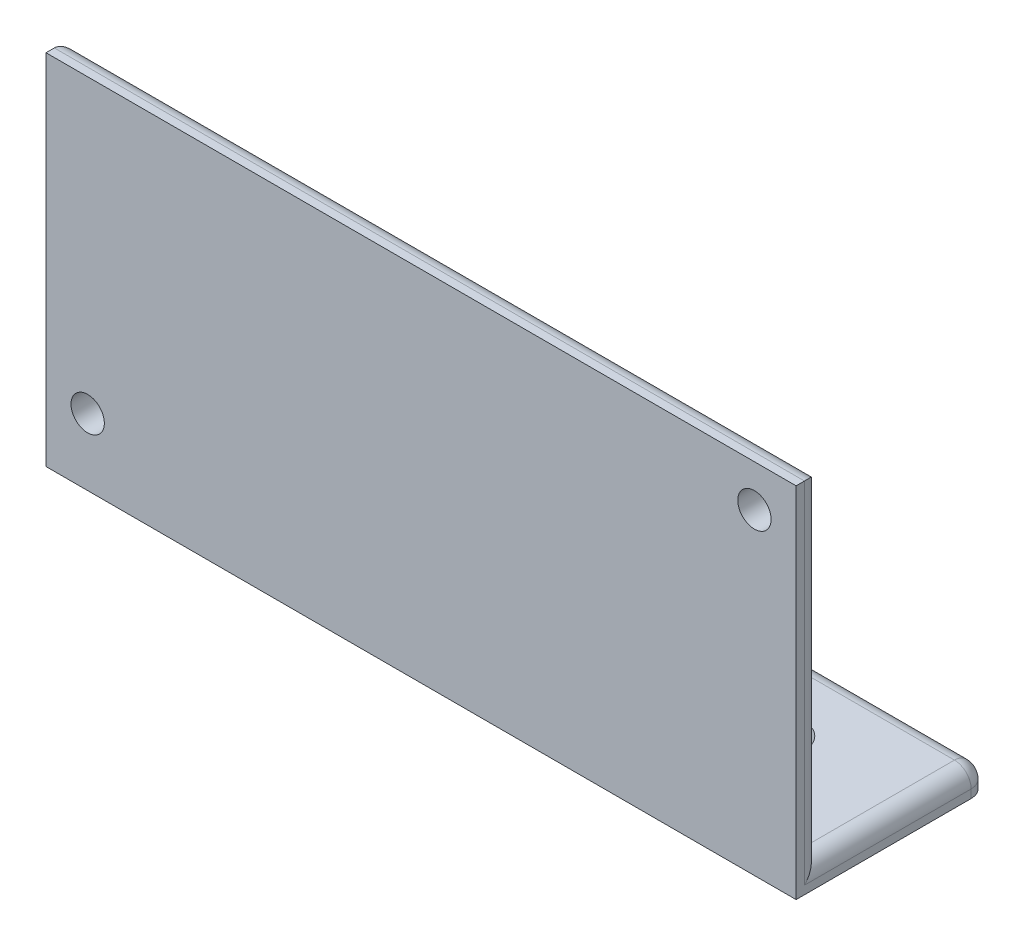
ISO-10303-21;
HEADER;
FILE_DESCRIPTION(('STEP AP214'),'2;1');
FILE_NAME('part.step','',(''),(''),'','','');
FILE_SCHEMA(('AUTOMOTIVE_DESIGN { 1 0 10303 214 1 1 1 1 }'));
ENDSEC;
DATA;
#1=APPLICATION_CONTEXT('core data for automotive mechanical design processes');
#2=APPLICATION_PROTOCOL_DEFINITION('international standard','automotive_design',2000,#1);
#3=PRODUCT_CONTEXT('',#1,'mechanical');
#4=PRODUCT('Part','Part','',(#3));
#5=PRODUCT_RELATED_PRODUCT_CATEGORY('part','',(#4));
#6=PRODUCT_DEFINITION_FORMATION('','',#4);
#7=PRODUCT_DEFINITION_CONTEXT('part definition',#1,'design');
#8=PRODUCT_DEFINITION('design','',#6,#7);
#9=PRODUCT_DEFINITION_SHAPE('','',#8);
#10=(LENGTH_UNIT() NAMED_UNIT(*) SI_UNIT(.MILLI.,.METRE.));
#11=(NAMED_UNIT(*) PLANE_ANGLE_UNIT() SI_UNIT($,.RADIAN.));
#12=(NAMED_UNIT(*) SI_UNIT($,.STERADIAN.) SOLID_ANGLE_UNIT());
#13=UNCERTAINTY_MEASURE_WITH_UNIT(LENGTH_MEASURE(1.E-05),#10,'distance_accuracy_value','');
#14=(GEOMETRIC_REPRESENTATION_CONTEXT(3) GLOBAL_UNCERTAINTY_ASSIGNED_CONTEXT((#13)) GLOBAL_UNIT_ASSIGNED_CONTEXT((#10,
#11,#12)) REPRESENTATION_CONTEXT('',''));
#15=CARTESIAN_POINT('',(0.,0.,0.));
#16=DIRECTION('',(0.,0.,1.));
#17=DIRECTION('',(1.,0.,0.));
#18=AXIS2_PLACEMENT_3D('',#15,#16,#17);
#19=CARTESIAN_POINT('',(0.,0.,1.5));
#20=DIRECTION('',(0.,0.,1.));
#21=DIRECTION('',(1.,0.,0.));
#22=AXIS2_PLACEMENT_3D('',#19,#20,#21);
#23=PLANE('',#22);
#24=CARTESIAN_POINT('',(20.,7.5,1.5));
#25=DIRECTION('',(0.,0.,1.));
#26=DIRECTION('',(1.,0.,0.));
#27=AXIS2_PLACEMENT_3D('',#24,#25,#26);
#28=CIRCLE('',#27,1.);
#29=CARTESIAN_POINT('',(21.,7.5,1.5));
#30=VERTEX_POINT('',#29);
#31=EDGE_CURVE('E169',#30,#30,#28,.T.);
#32=ORIENTED_EDGE('',*,*,#31,.F.);
#33=EDGE_LOOP('',(#32));
#34=FACE_BOUND('',#33,.T.);
#35=DIRECTION('',(0.,-1.,0.));
#36=VECTOR('',#35,1.);
#37=CARTESIAN_POINT('',(-22.5,10.,1.5));
#38=LINE('',#37,#36);
#39=CARTESIAN_POINT('',(-22.5,10.,1.5));
#40=VERTEX_POINT('',#39);
#41=CARTESIAN_POINT('',(-22.5,-11.5,1.5));
#42=VERTEX_POINT('',#41);
#43=EDGE_CURVE('E146',#40,#42,#38,.T.);
#44=ORIENTED_EDGE('',*,*,#43,.T.);
#45=DIRECTION('',(-1.,0.,0.));
#46=VECTOR('',#45,1.);
#47=CARTESIAN_POINT('',(22.5,-11.5,1.5));
#48=LINE('',#47,#46);
#49=CARTESIAN_POINT('',(22.5,-11.5,1.5));
#50=VERTEX_POINT('',#49);
#51=EDGE_CURVE('E127',#50,#42,#48,.T.);
#52=ORIENTED_EDGE('',*,*,#51,.F.);
#53=DIRECTION('',(0.,1.,0.));
#54=VECTOR('',#53,1.);
#55=CARTESIAN_POINT('',(22.5,10.,1.5));
#56=LINE('',#55,#54);
#57=CARTESIAN_POINT('',(22.5,10.,1.5));
#58=VERTEX_POINT('',#57);
#59=EDGE_CURVE('E138',#50,#58,#56,.T.);
#60=ORIENTED_EDGE('',*,*,#59,.T.);
#61=DIRECTION('',(-1.,0.,0.));
#62=VECTOR('',#61,1.);
#63=CARTESIAN_POINT('',(-22.5,10.,1.5));
#64=LINE('',#63,#62);
#65=EDGE_CURVE('E145',#58,#40,#64,.T.);
#66=ORIENTED_EDGE('',*,*,#65,.T.);
#67=EDGE_LOOP('',(#44,#52,#60,#66));
#68=FACE_BOUND('',#67,.T.);
#69=CARTESIAN_POINT('',(-20.0000000000001,-7.49999999999986,1.5));
#70=DIRECTION('',(0.,0.,1.));
#71=DIRECTION('',(1.,0.,0.));
#72=AXIS2_PLACEMENT_3D('',#69,#70,#71);
#73=CIRCLE('',#72,1.);
#74=CARTESIAN_POINT('',(-19.0000000000001,-7.49999999999986,1.5));
#75=VERTEX_POINT('',#74);
#76=EDGE_CURVE('E161',#75,#75,#73,.T.);
#77=ORIENTED_EDGE('',*,*,#76,.F.);
#78=EDGE_LOOP('',(#77));
#79=FACE_BOUND('',#78,.T.);
#80=ADVANCED_FACE('F38',(#34,#68,#79),#23,.T.);
#81=CARTESIAN_POINT('',(0.,0.,0.));
#82=DIRECTION('',(0.,0.,1.));
#83=DIRECTION('',(1.,0.,0.));
#84=AXIS2_PLACEMENT_3D('',#81,#82,#83);
#85=PLANE('',#84);
#86=DIRECTION('',(1.,0.,0.));
#87=VECTOR('',#86,1.);
#88=CARTESIAN_POINT('',(-22.5,-10.,0.));
#89=LINE('',#88,#87);
#90=CARTESIAN_POINT('',(-21.5,-10.,0.));
#91=VERTEX_POINT('',#90);
#92=CARTESIAN_POINT('',(21.5,-10.,0.));
#93=VERTEX_POINT('',#92);
#94=EDGE_CURVE('E173',#91,#93,#89,.T.);
#95=ORIENTED_EDGE('',*,*,#94,.F.);
#96=DIRECTION('',(0.,-1.,0.));
#97=VECTOR('',#96,1.);
#98=CARTESIAN_POINT('',(-21.5,0.,0.));
#99=LINE('',#98,#97);
#100=CARTESIAN_POINT('',(-21.5,9.,0.));
#101=VERTEX_POINT('',#100);
#102=EDGE_CURVE('E48',#91,#101,#99,.F.);
#103=ORIENTED_EDGE('',*,*,#102,.T.);
#104=DIRECTION('',(-1.,0.,0.));
#105=VECTOR('',#104,1.);
#106=CARTESIAN_POINT('',(0.,9.,0.));
#107=LINE('',#106,#105);
#108=CARTESIAN_POINT('',(21.5,9.,0.));
#109=VERTEX_POINT('',#108);
#110=EDGE_CURVE('E56',#101,#109,#107,.F.);
#111=ORIENTED_EDGE('',*,*,#110,.T.);
#112=DIRECTION('',(0.,1.,0.));
#113=VECTOR('',#112,1.);
#114=CARTESIAN_POINT('',(21.5,0.,0.));
#115=LINE('',#114,#113);
#116=EDGE_CURVE('E235',#109,#93,#115,.F.);
#117=ORIENTED_EDGE('',*,*,#116,.T.);
#118=EDGE_LOOP('',(#95,#103,#111,#117));
#119=FACE_BOUND('',#118,.T.);
#120=CARTESIAN_POINT('',(20.,7.5,0.));
#121=DIRECTION('',(0.,0.,1.));
#122=DIRECTION('',(1.,0.,0.));
#123=AXIS2_PLACEMENT_3D('',#120,#121,#122);
#124=CIRCLE('',#123,1.);
#125=CARTESIAN_POINT('',(21.,7.5,0.));
#126=VERTEX_POINT('',#125);
#127=EDGE_CURVE('E165',#126,#126,#124,.T.);
#128=ORIENTED_EDGE('',*,*,#127,.T.);
#129=EDGE_LOOP('',(#128));
#130=FACE_BOUND('',#129,.T.);
#131=CARTESIAN_POINT('',(-20.0000000000001,-7.49999999999986,0.));
#132=DIRECTION('',(0.,0.,1.));
#133=DIRECTION('',(1.,0.,0.));
#134=AXIS2_PLACEMENT_3D('',#131,#132,#133);
#135=CIRCLE('',#134,1.);
#136=CARTESIAN_POINT('',(-19.0000000000001,-7.49999999999986,0.));
#137=VERTEX_POINT('',#136);
#138=EDGE_CURVE('E160',#137,#137,#135,.T.);
#139=ORIENTED_EDGE('',*,*,#138,.T.);
#140=EDGE_LOOP('',(#139));
#141=FACE_BOUND('',#140,.T.);
#142=ADVANCED_FACE('F319',(#119,#130,#141),#85,.F.);
#143=CARTESIAN_POINT('',(-22.5,10.,1.5));
#144=DIRECTION('',(1.,0.,0.));
#145=DIRECTION('',(0.,1.,0.));
#146=AXIS2_PLACEMENT_3D('',#143,#144,#145);
#147=PLANE('',#146);
#148=DIRECTION('',(0.,0.,-1.));
#149=VECTOR('',#148,1.);
#150=CARTESIAN_POINT('',(-22.5,-11.,-10.));
#151=LINE('',#150,#149);
#152=CARTESIAN_POINT('',(-22.5,-11.,1.));
#153=VERTEX_POINT('',#152);
#154=CARTESIAN_POINT('',(-22.5,-11.,-9.00000000000001));
#155=VERTEX_POINT('',#154);
#156=EDGE_CURVE('E203',#153,#155,#151,.T.);
#157=ORIENTED_EDGE('',*,*,#156,.T.);
#158=DIRECTION('',(0.,1.,0.));
#159=VECTOR('',#158,1.);
#160=CARTESIAN_POINT('',(-22.5,10.,-9.00000000000001));
#161=LINE('',#160,#159);
#162=CARTESIAN_POINT('',(-22.5,-11.5,-9.00000000000001));
#163=VERTEX_POINT('',#162);
#164=EDGE_CURVE('E206',#155,#163,#161,.F.);
#165=ORIENTED_EDGE('',*,*,#164,.T.);
#166=DIRECTION('',(0.,0.,-1.));
#167=VECTOR('',#166,1.);
#168=CARTESIAN_POINT('',(-22.5,-11.5,1.5));
#169=LINE('',#168,#167);
#170=EDGE_CURVE('E151',#42,#163,#169,.T.);
#171=ORIENTED_EDGE('',*,*,#170,.F.);
#172=ORIENTED_EDGE('',*,*,#43,.F.);
#173=DIRECTION('',(0.,0.,-1.));
#174=VECTOR('',#173,1.);
#175=CARTESIAN_POINT('',(-22.5,10.,1.5));
#176=LINE('',#175,#174);
#177=CARTESIAN_POINT('',(-22.5,10.,1.));
#178=VERTEX_POINT('',#177);
#179=EDGE_CURVE('E181',#40,#178,#176,.T.);
#180=ORIENTED_EDGE('',*,*,#179,.T.);
#181=DIRECTION('',(0.,-1.,0.));
#182=VECTOR('',#181,1.);
#183=CARTESIAN_POINT('',(-22.5,10.,1.));
#184=LINE('',#183,#182);
#185=EDGE_CURVE('E200',#178,#153,#184,.T.);
#186=ORIENTED_EDGE('',*,*,#185,.T.);
#187=EDGE_LOOP('',(#157,#165,#171,#172,#180,#186));
#188=FACE_BOUND('',#187,.T.);
#189=ADVANCED_FACE('F327',(#188),#147,.F.);
#190=CARTESIAN_POINT('',(22.5,10.,1.5));
#191=DIRECTION('',(-1.,0.,0.));
#192=DIRECTION('',(0.,0.,1.));
#193=AXIS2_PLACEMENT_3D('',#190,#191,#192);
#194=PLANE('',#193);
#195=DIRECTION('',(0.,0.,1.));
#196=VECTOR('',#195,1.);
#197=CARTESIAN_POINT('',(22.5,-11.5,1.5));
#198=LINE('',#197,#196);
#199=CARTESIAN_POINT('',(22.5,-11.5,-9.));
#200=VERTEX_POINT('',#199);
#201=EDGE_CURVE('E121',#200,#50,#198,.T.);
#202=ORIENTED_EDGE('',*,*,#201,.F.);
#203=DIRECTION('',(0.,1.,0.));
#204=VECTOR('',#203,1.);
#205=CARTESIAN_POINT('',(22.5,10.,-9.));
#206=LINE('',#205,#204);
#207=CARTESIAN_POINT('',(22.5,-11.,-9.));
#208=VERTEX_POINT('',#207);
#209=EDGE_CURVE('E220',#200,#208,#206,.T.);
#210=ORIENTED_EDGE('',*,*,#209,.T.);
#211=DIRECTION('',(0.,0.,1.));
#212=VECTOR('',#211,1.);
#213=CARTESIAN_POINT('',(22.5,-11.,0.));
#214=LINE('',#213,#212);
#215=CARTESIAN_POINT('',(22.5,-11.,1.));
#216=VERTEX_POINT('',#215);
#217=EDGE_CURVE('E217',#208,#216,#214,.T.);
#218=ORIENTED_EDGE('',*,*,#217,.T.);
#219=DIRECTION('',(0.,1.,0.));
#220=VECTOR('',#219,1.);
#221=CARTESIAN_POINT('',(22.5,10.,1.));
#222=LINE('',#221,#220);
#223=CARTESIAN_POINT('',(22.5,10.,1.));
#224=VERTEX_POINT('',#223);
#225=EDGE_CURVE('E214',#216,#224,#222,.T.);
#226=ORIENTED_EDGE('',*,*,#225,.T.);
#227=DIRECTION('',(0.,0.,-1.));
#228=VECTOR('',#227,1.);
#229=CARTESIAN_POINT('',(22.5,10.,1.5));
#230=LINE('',#229,#228);
#231=EDGE_CURVE('E141',#58,#224,#230,.T.);
#232=ORIENTED_EDGE('',*,*,#231,.F.);
#233=ORIENTED_EDGE('',*,*,#59,.F.);
#234=EDGE_LOOP('',(#202,#210,#218,#226,#232,#233));
#235=FACE_BOUND('',#234,.T.);
#236=ADVANCED_FACE('F139',(#235),#194,.F.);
#237=CARTESIAN_POINT('',(-22.5,10.,1.5));
#238=DIRECTION('',(0.,-1.,0.));
#239=DIRECTION('',(0.,0.,-1.));
#240=AXIS2_PLACEMENT_3D('',#237,#238,#239);
#241=PLANE('',#240);
#242=ORIENTED_EDGE('',*,*,#231,.T.);
#243=DIRECTION('',(-1.,0.,0.));
#244=VECTOR('',#243,1.);
#245=CARTESIAN_POINT('',(-22.5,10.,1.));
#246=LINE('',#245,#244);
#247=EDGE_CURVE('E11',#224,#178,#246,.T.);
#248=ORIENTED_EDGE('',*,*,#247,.T.);
#249=ORIENTED_EDGE('',*,*,#179,.F.);
#250=ORIENTED_EDGE('',*,*,#65,.F.);
#251=EDGE_LOOP('',(#242,#248,#249,#250));
#252=FACE_BOUND('',#251,.T.);
#253=ADVANCED_FACE('F334',(#252),#241,.F.);
#254=CARTESIAN_POINT('',(20.,7.5,1.5));
#255=DIRECTION('',(0.,0.,-1.));
#256=DIRECTION('',(-1.,0.,0.));
#257=AXIS2_PLACEMENT_3D('',#254,#255,#256);
#258=CYLINDRICAL_SURFACE('',#257,1.);
#259=ORIENTED_EDGE('',*,*,#31,.T.);
#260=EDGE_LOOP('',(#259));
#261=FACE_BOUND('',#260,.T.);
#262=ORIENTED_EDGE('',*,*,#127,.F.);
#263=EDGE_LOOP('',(#262));
#264=FACE_BOUND('',#263,.T.);
#265=ADVANCED_FACE('F331',(#261,#264),#258,.F.);
#266=CARTESIAN_POINT('',(-20.0000000000001,-7.49999999999986,1.5));
#267=DIRECTION('',(0.,0.,-1.));
#268=DIRECTION('',(-1.,0.,0.));
#269=AXIS2_PLACEMENT_3D('',#266,#267,#268);
#270=CYLINDRICAL_SURFACE('',#269,1.);
#271=ORIENTED_EDGE('',*,*,#76,.T.);
#272=EDGE_LOOP('',(#271));
#273=FACE_BOUND('',#272,.T.);
#274=ORIENTED_EDGE('',*,*,#138,.F.);
#275=EDGE_LOOP('',(#274));
#276=FACE_BOUND('',#275,.T.);
#277=ADVANCED_FACE('F404',(#273,#276),#270,.F.);
#278=CARTESIAN_POINT('',(0.,-11.5,0.));
#279=DIRECTION('',(0.,1.,0.));
#280=DIRECTION('',(0.,0.,1.));
#281=AXIS2_PLACEMENT_3D('',#278,#279,#280);
#282=PLANE('',#281);
#283=ORIENTED_EDGE('',*,*,#170,.T.);
#284=CARTESIAN_POINT('',(-21.5,-11.5,-9.00000000000001));
#285=DIRECTION('',(0.,1.,0.));
#286=DIRECTION('',(0.,0.,1.));
#287=AXIS2_PLACEMENT_3D('',#284,#285,#286);
#288=CIRCLE('',#287,1.);
#289=CARTESIAN_POINT('',(-21.5,-11.5,-10.));
#290=VERTEX_POINT('',#289);
#291=EDGE_CURVE('E211',#163,#290,#288,.F.);
#292=ORIENTED_EDGE('',*,*,#291,.T.);
#293=DIRECTION('',(1.,0.,0.));
#294=VECTOR('',#293,1.);
#295=CARTESIAN_POINT('',(22.5,-11.5,-10.));
#296=LINE('',#295,#294);
#297=CARTESIAN_POINT('',(21.5,-11.5,-10.));
#298=VERTEX_POINT('',#297);
#299=EDGE_CURVE('E154',#290,#298,#296,.T.);
#300=ORIENTED_EDGE('',*,*,#299,.T.);
#301=CARTESIAN_POINT('',(21.5,-11.5,-9.));
#302=DIRECTION('',(0.,1.,0.));
#303=DIRECTION('',(0.,0.,1.));
#304=AXIS2_PLACEMENT_3D('',#301,#302,#303);
#305=CIRCLE('',#304,1.);
#306=EDGE_CURVE('E131',#298,#200,#305,.F.);
#307=ORIENTED_EDGE('',*,*,#306,.T.);
#308=ORIENTED_EDGE('',*,*,#201,.T.);
#309=ORIENTED_EDGE('',*,*,#51,.T.);
#310=EDGE_LOOP('',(#283,#292,#300,#307,#308,#309));
#311=FACE_BOUND('',#310,.T.);
#312=CARTESIAN_POINT('',(-15.,-11.5,-5.));
#313=DIRECTION('',(0.,-1.,0.));
#314=DIRECTION('',(0.,0.,-1.));
#315=AXIS2_PLACEMENT_3D('',#312,#313,#314);
#316=CIRCLE('',#315,1.5);
#317=CARTESIAN_POINT('',(-15.,-11.5,-6.5));
#318=VERTEX_POINT('',#317);
#319=EDGE_CURVE('E135',#318,#318,#316,.T.);
#320=ORIENTED_EDGE('',*,*,#319,.F.);
#321=EDGE_LOOP('',(#320));
#322=FACE_BOUND('',#321,.T.);
#323=CARTESIAN_POINT('',(15.,-11.5,-5.));
#324=DIRECTION('',(0.,-1.,0.));
#325=DIRECTION('',(0.,0.,1.));
#326=AXIS2_PLACEMENT_3D('',#323,#324,#325);
#327=CIRCLE('',#326,1.5);
#328=CARTESIAN_POINT('',(15.,-11.5,-3.5));
#329=VERTEX_POINT('',#328);
#330=EDGE_CURVE('E284',#329,#329,#327,.T.);
#331=ORIENTED_EDGE('',*,*,#330,.F.);
#332=EDGE_LOOP('',(#331));
#333=FACE_BOUND('',#332,.T.);
#334=ADVANCED_FACE('F124',(#311,#322,#333),#282,.F.);
#335=CARTESIAN_POINT('',(0.,-10.,0.));
#336=DIRECTION('',(0.,1.,0.));
#337=DIRECTION('',(0.,0.,1.));
#338=AXIS2_PLACEMENT_3D('',#335,#336,#337);
#339=PLANE('',#338);
#340=CARTESIAN_POINT('',(-15.,-10.,-5.));
#341=DIRECTION('',(0.,-1.,0.));
#342=DIRECTION('',(0.,0.,-1.));
#343=AXIS2_PLACEMENT_3D('',#340,#341,#342);
#344=CIRCLE('',#343,1.5);
#345=CARTESIAN_POINT('',(-15.,-10.,-6.5));
#346=VERTEX_POINT('',#345);
#347=EDGE_CURVE('E290',#346,#346,#344,.T.);
#348=ORIENTED_EDGE('',*,*,#347,.T.);
#349=EDGE_LOOP('',(#348));
#350=FACE_BOUND('',#349,.T.);
#351=ORIENTED_EDGE('',*,*,#94,.T.);
#352=DIRECTION('',(0.,0.,1.));
#353=VECTOR('',#352,1.);
#354=CARTESIAN_POINT('',(21.5,-10.,-10.));
#355=LINE('',#354,#353);
#356=CARTESIAN_POINT('',(21.5,-10.,-9.));
#357=VERTEX_POINT('',#356);
#358=EDGE_CURVE('E230',#93,#357,#355,.F.);
#359=ORIENTED_EDGE('',*,*,#358,.T.);
#360=DIRECTION('',(1.,0.,0.));
#361=VECTOR('',#360,1.);
#362=CARTESIAN_POINT('',(-22.5,-10.,-9.00000000000001));
#363=LINE('',#362,#361);
#364=CARTESIAN_POINT('',(-21.5,-10.,-9.00000000000001));
#365=VERTEX_POINT('',#364);
#366=EDGE_CURVE('E226',#357,#365,#363,.F.);
#367=ORIENTED_EDGE('',*,*,#366,.T.);
#368=DIRECTION('',(0.,0.,-1.));
#369=VECTOR('',#368,1.);
#370=CARTESIAN_POINT('',(-21.5,-10.,0.));
#371=LINE('',#370,#369);
#372=EDGE_CURVE('E223',#365,#91,#371,.F.);
#373=ORIENTED_EDGE('',*,*,#372,.T.);
#374=EDGE_LOOP('',(#351,#359,#367,#373));
#375=FACE_BOUND('',#374,.T.);
#376=CARTESIAN_POINT('',(15.,-10.,-5.));
#377=DIRECTION('',(0.,-1.,0.));
#378=DIRECTION('',(0.,0.,1.));
#379=AXIS2_PLACEMENT_3D('',#376,#377,#378);
#380=CIRCLE('',#379,1.5);
#381=CARTESIAN_POINT('',(15.,-10.,-3.5));
#382=VERTEX_POINT('',#381);
#383=EDGE_CURVE('E277',#382,#382,#380,.T.);
#384=ORIENTED_EDGE('',*,*,#383,.T.);
#385=EDGE_LOOP('',(#384));
#386=FACE_BOUND('',#385,.T.);
#387=ADVANCED_FACE('F299',(#350,#375,#386),#339,.T.);
#388=CARTESIAN_POINT('',(22.5,-11.5,-10.));
#389=DIRECTION('',(0.,0.,1.));
#390=DIRECTION('',(1.,0.,0.));
#391=AXIS2_PLACEMENT_3D('',#388,#389,#390);
#392=PLANE('',#391);
#393=ORIENTED_EDGE('',*,*,#299,.F.);
#394=DIRECTION('',(0.,1.,0.));
#395=VECTOR('',#394,1.);
#396=CARTESIAN_POINT('',(-21.5,-11.5,-10.));
#397=LINE('',#396,#395);
#398=CARTESIAN_POINT('',(-21.5,-11.,-10.));
#399=VERTEX_POINT('',#398);
#400=EDGE_CURVE('E196',#290,#399,#397,.T.);
#401=ORIENTED_EDGE('',*,*,#400,.T.);
#402=DIRECTION('',(1.,0.,0.));
#403=VECTOR('',#402,1.);
#404=CARTESIAN_POINT('',(22.5,-11.,-10.));
#405=LINE('',#404,#403);
#406=CARTESIAN_POINT('',(21.5,-11.,-10.));
#407=VERTEX_POINT('',#406);
#408=EDGE_CURVE('E190',#399,#407,#405,.T.);
#409=ORIENTED_EDGE('',*,*,#408,.T.);
#410=DIRECTION('',(0.,1.,0.));
#411=VECTOR('',#410,1.);
#412=CARTESIAN_POINT('',(21.5,-11.5,-10.));
#413=LINE('',#412,#411);
#414=EDGE_CURVE('E193',#407,#298,#413,.F.);
#415=ORIENTED_EDGE('',*,*,#414,.T.);
#416=EDGE_LOOP('',(#393,#401,#409,#415));
#417=FACE_BOUND('',#416,.T.);
#418=ADVANCED_FACE('F305',(#417),#392,.F.);
#419=CARTESIAN_POINT('',(-15.,-11.5,-5.));
#420=DIRECTION('',(0.,1.,0.));
#421=DIRECTION('',(0.,0.,1.));
#422=AXIS2_PLACEMENT_3D('',#419,#420,#421);
#423=CYLINDRICAL_SURFACE('',#422,1.5);
#424=ORIENTED_EDGE('',*,*,#319,.T.);
#425=EDGE_LOOP('',(#424));
#426=FACE_BOUND('',#425,.T.);
#427=ORIENTED_EDGE('',*,*,#347,.F.);
#428=EDGE_LOOP('',(#427));
#429=FACE_BOUND('',#428,.T.);
#430=ADVANCED_FACE('F302',(#426,#429),#423,.F.);
#431=CARTESIAN_POINT('',(15.,-11.5,-5.));
#432=DIRECTION('',(0.,1.,0.));
#433=DIRECTION('',(0.,0.,1.));
#434=AXIS2_PLACEMENT_3D('',#431,#432,#433);
#435=CYLINDRICAL_SURFACE('',#434,1.5);
#436=ORIENTED_EDGE('',*,*,#330,.T.);
#437=EDGE_LOOP('',(#436));
#438=FACE_BOUND('',#437,.T.);
#439=ORIENTED_EDGE('',*,*,#383,.F.);
#440=EDGE_LOOP('',(#439));
#441=FACE_BOUND('',#440,.T.);
#442=ADVANCED_FACE('F304',(#438,#441),#435,.F.);
#443=CARTESIAN_POINT('',(21.5,10.,1.));
#444=DIRECTION('',(0.,1.,0.));
#445=DIRECTION('',(0.,0.,1.));
#446=AXIS2_PLACEMENT_3D('',#443,#444,#445);
#447=CYLINDRICAL_SURFACE('',#446,1.);
#448=CARTESIAN_POINT('',(21.5,9.,1.));
#449=DIRECTION('',(-0.707106781186547,0.707106781186547,0.));
#450=DIRECTION('',(-0.707106781186547,-0.707106781186547,0.));
#451=AXIS2_PLACEMENT_3D('',#448,#449,#450);
#452=ELLIPSE('',#451,1.41421356237309,1.);
#453=EDGE_CURVE('E269',#224,#109,#452,.T.);
#454=ORIENTED_EDGE('',*,*,#453,.F.);
#455=ORIENTED_EDGE('',*,*,#225,.F.);
#456=CARTESIAN_POINT('',(21.5,-11.,1.));
#457=DIRECTION('',(0.,-0.707106781186547,-0.707106781186547));
#458=DIRECTION('',(0.,0.707106781186547,-0.707106781186547));
#459=AXIS2_PLACEMENT_3D('',#456,#457,#458);
#460=ELLIPSE('',#459,1.41421356237309,1.);
#461=EDGE_CURVE('E42',#93,#216,#460,.T.);
#462=ORIENTED_EDGE('',*,*,#461,.F.);
#463=ORIENTED_EDGE('',*,*,#116,.F.);
#464=EDGE_LOOP('',(#454,#455,#462,#463));
#465=FACE_BOUND('',#464,.T.);
#466=ADVANCED_FACE('F40',(#465),#447,.T.);
#467=CARTESIAN_POINT('',(21.5,10.,-9.));
#468=DIRECTION('',(0.,1.,0.));
#469=DIRECTION('',(0.,0.,1.));
#470=AXIS2_PLACEMENT_3D('',#467,#468,#469);
#471=CYLINDRICAL_SURFACE('',#470,1.);
#472=ORIENTED_EDGE('',*,*,#306,.F.);
#473=ORIENTED_EDGE('',*,*,#414,.F.);
#474=CARTESIAN_POINT('',(21.5,-11.,-9.));
#475=DIRECTION('',(0.,1.,0.));
#476=DIRECTION('',(0.,0.,1.));
#477=AXIS2_PLACEMENT_3D('',#474,#475,#476);
#478=CIRCLE('',#477,1.);
#479=EDGE_CURVE('E266',#208,#407,#478,.T.);
#480=ORIENTED_EDGE('',*,*,#479,.F.);
#481=ORIENTED_EDGE('',*,*,#209,.F.);
#482=EDGE_LOOP('',(#472,#473,#480,#481));
#483=FACE_BOUND('',#482,.T.);
#484=ADVANCED_FACE('F372',(#483),#471,.T.);
#485=CARTESIAN_POINT('',(21.5,-11.,1.5));
#486=DIRECTION('',(0.,0.,-1.));
#487=DIRECTION('',(-1.,0.,0.));
#488=AXIS2_PLACEMENT_3D('',#485,#486,#487);
#489=CYLINDRICAL_SURFACE('',#488,1.);
#490=ORIENTED_EDGE('',*,*,#461,.T.);
#491=ORIENTED_EDGE('',*,*,#217,.F.);
#492=CARTESIAN_POINT('',(21.5,-11.,-9.));
#493=DIRECTION('',(0.,0.,-1.));
#494=DIRECTION('',(-1.,0.,0.));
#495=AXIS2_PLACEMENT_3D('',#492,#493,#494);
#496=CIRCLE('',#495,1.);
#497=EDGE_CURVE('E262',#357,#208,#496,.T.);
#498=ORIENTED_EDGE('',*,*,#497,.F.);
#499=ORIENTED_EDGE('',*,*,#358,.F.);
#500=EDGE_LOOP('',(#490,#491,#498,#499));
#501=FACE_BOUND('',#500,.T.);
#502=ADVANCED_FACE('F370',(#501),#489,.T.);
#503=CARTESIAN_POINT('',(-22.5,9.,1.));
#504=DIRECTION('',(-1.,0.,0.));
#505=DIRECTION('',(0.,0.,1.));
#506=AXIS2_PLACEMENT_3D('',#503,#504,#505);
#507=CYLINDRICAL_SURFACE('',#506,1.);
#508=ORIENTED_EDGE('',*,*,#453,.T.);
#509=ORIENTED_EDGE('',*,*,#110,.F.);
#510=CARTESIAN_POINT('',(-21.5,9.,1.));
#511=DIRECTION('',(-0.707106781186547,-0.707106781186548,0.));
#512=DIRECTION('',(-0.707106781186548,0.707106781186547,0.));
#513=AXIS2_PLACEMENT_3D('',#510,#511,#512);
#514=ELLIPSE('',#513,1.4142135623731,1.);
#515=EDGE_CURVE('E258',#178,#101,#514,.T.);
#516=ORIENTED_EDGE('',*,*,#515,.F.);
#517=ORIENTED_EDGE('',*,*,#247,.F.);
#518=EDGE_LOOP('',(#508,#509,#516,#517));
#519=FACE_BOUND('',#518,.T.);
#520=ADVANCED_FACE('F366',(#519),#507,.T.);
#521=CARTESIAN_POINT('',(21.5,-11.,-9.));
#522=DIRECTION('',(0.,0.,1.));
#523=DIRECTION('',(1.,0.,0.));
#524=AXIS2_PLACEMENT_3D('',#521,#522,#523);
#525=SPHERICAL_SURFACE('',#524,1.);
#526=ORIENTED_EDGE('',*,*,#497,.T.);
#527=ORIENTED_EDGE('',*,*,#479,.T.);
#528=CARTESIAN_POINT('',(21.5,-11.,-9.));
#529=DIRECTION('',(1.,0.,0.));
#530=DIRECTION('',(0.,0.,-1.));
#531=AXIS2_PLACEMENT_3D('',#528,#529,#530);
#532=CIRCLE('',#531,1.);
#533=EDGE_CURVE('E254',#357,#407,#532,.F.);
#534=ORIENTED_EDGE('',*,*,#533,.F.);
#535=EDGE_LOOP('',(#526,#527,#534));
#536=FACE_BOUND('',#535,.T.);
#537=ADVANCED_FACE('F362',(#536),#525,.T.);
#538=CARTESIAN_POINT('',(-21.5,10.,1.));
#539=DIRECTION('',(0.,-1.,0.));
#540=DIRECTION('',(1.,0.,0.));
#541=AXIS2_PLACEMENT_3D('',#538,#539,#540);
#542=CYLINDRICAL_SURFACE('',#541,1.);
#543=ORIENTED_EDGE('',*,*,#515,.T.);
#544=ORIENTED_EDGE('',*,*,#102,.F.);
#545=CARTESIAN_POINT('',(-21.5,-11.,1.));
#546=DIRECTION('',(0.,0.707106781186547,0.707106781186547));
#547=DIRECTION('',(0.,-0.707106781186547,0.707106781186547));
#548=AXIS2_PLACEMENT_3D('',#545,#546,#547);
#549=ELLIPSE('',#548,1.41421356237309,1.);
#550=EDGE_CURVE('E250',#153,#91,#549,.F.);
#551=ORIENTED_EDGE('',*,*,#550,.F.);
#552=ORIENTED_EDGE('',*,*,#185,.F.);
#553=EDGE_LOOP('',(#543,#544,#551,#552));
#554=FACE_BOUND('',#553,.T.);
#555=ADVANCED_FACE('F358',(#554),#542,.T.);
#556=CARTESIAN_POINT('',(22.5,-11.,-9.));
#557=DIRECTION('',(-1.,0.,0.));
#558=DIRECTION('',(0.,0.,1.));
#559=AXIS2_PLACEMENT_3D('',#556,#557,#558);
#560=CYLINDRICAL_SURFACE('',#559,1.);
#561=ORIENTED_EDGE('',*,*,#533,.T.);
#562=ORIENTED_EDGE('',*,*,#408,.F.);
#563=CARTESIAN_POINT('',(-21.5,-11.,-9.00000000000001));
#564=DIRECTION('',(-1.,0.,0.));
#565=DIRECTION('',(0.,0.,1.));
#566=AXIS2_PLACEMENT_3D('',#563,#564,#565);
#567=CIRCLE('',#566,1.);
#568=EDGE_CURVE('E246',#365,#399,#567,.T.);
#569=ORIENTED_EDGE('',*,*,#568,.F.);
#570=ORIENTED_EDGE('',*,*,#366,.F.);
#571=EDGE_LOOP('',(#561,#562,#569,#570));
#572=FACE_BOUND('',#571,.T.);
#573=ADVANCED_FACE('F354',(#572),#560,.T.);
#574=CARTESIAN_POINT('',(-21.5,-11.,1.5));
#575=DIRECTION('',(0.,0.,1.));
#576=DIRECTION('',(1.,0.,0.));
#577=AXIS2_PLACEMENT_3D('',#574,#575,#576);
#578=CYLINDRICAL_SURFACE('',#577,1.);
#579=ORIENTED_EDGE('',*,*,#550,.T.);
#580=ORIENTED_EDGE('',*,*,#372,.F.);
#581=CARTESIAN_POINT('',(-21.5,-11.,-9.00000000000001));
#582=DIRECTION('',(0.,0.,-1.));
#583=DIRECTION('',(-1.,0.,0.));
#584=AXIS2_PLACEMENT_3D('',#581,#582,#583);
#585=CIRCLE('',#584,1.);
#586=EDGE_CURVE('E243',#155,#365,#585,.T.);
#587=ORIENTED_EDGE('',*,*,#586,.F.);
#588=ORIENTED_EDGE('',*,*,#156,.F.);
#589=EDGE_LOOP('',(#579,#580,#587,#588));
#590=FACE_BOUND('',#589,.T.);
#591=ADVANCED_FACE('F350',(#590),#578,.T.);
#592=CARTESIAN_POINT('',(-21.5,-11.,-9.00000000000001));
#593=DIRECTION('',(0.,0.,1.));
#594=DIRECTION('',(1.,0.,0.));
#595=AXIS2_PLACEMENT_3D('',#592,#593,#594);
#596=SPHERICAL_SURFACE('',#595,1.);
#597=ORIENTED_EDGE('',*,*,#586,.T.);
#598=ORIENTED_EDGE('',*,*,#568,.T.);
#599=CARTESIAN_POINT('',(-21.5,-11.,-9.00000000000001));
#600=DIRECTION('',(0.,1.,0.));
#601=DIRECTION('',(0.,0.,1.));
#602=AXIS2_PLACEMENT_3D('',#599,#600,#601);
#603=CIRCLE('',#602,1.);
#604=EDGE_CURVE('E240',#155,#399,#603,.F.);
#605=ORIENTED_EDGE('',*,*,#604,.F.);
#606=EDGE_LOOP('',(#597,#598,#605));
#607=FACE_BOUND('',#606,.T.);
#608=ADVANCED_FACE('F346',(#607),#596,.T.);
#609=CARTESIAN_POINT('',(-21.5,-11.5,-9.00000000000001));
#610=DIRECTION('',(0.,1.,0.));
#611=DIRECTION('',(-1.,0.,0.));
#612=AXIS2_PLACEMENT_3D('',#609,#610,#611);
#613=CYLINDRICAL_SURFACE('',#612,1.);
#614=ORIENTED_EDGE('',*,*,#291,.F.);
#615=ORIENTED_EDGE('',*,*,#164,.F.);
#616=ORIENTED_EDGE('',*,*,#604,.T.);
#617=ORIENTED_EDGE('',*,*,#400,.F.);
#618=EDGE_LOOP('',(#614,#615,#616,#617));
#619=FACE_BOUND('',#618,.T.);
#620=ADVANCED_FACE('F343',(#619),#613,.T.);
#621=CLOSED_SHELL('',(#80,#142,#189,#236,#253,#265,#277,#334,#387,#418,#430,#442,#466,#484,#502,
#520,#537,#555,#573,#591,#608,#620));
#622=MANIFOLD_SOLID_BREP('B2',#621);
#623=ADVANCED_BREP_SHAPE_REPRESENTATION('',(#18,#622),#14);
#624=SHAPE_DEFINITION_REPRESENTATION(#9,#623);
ENDSEC;
END-ISO-10303-21;
